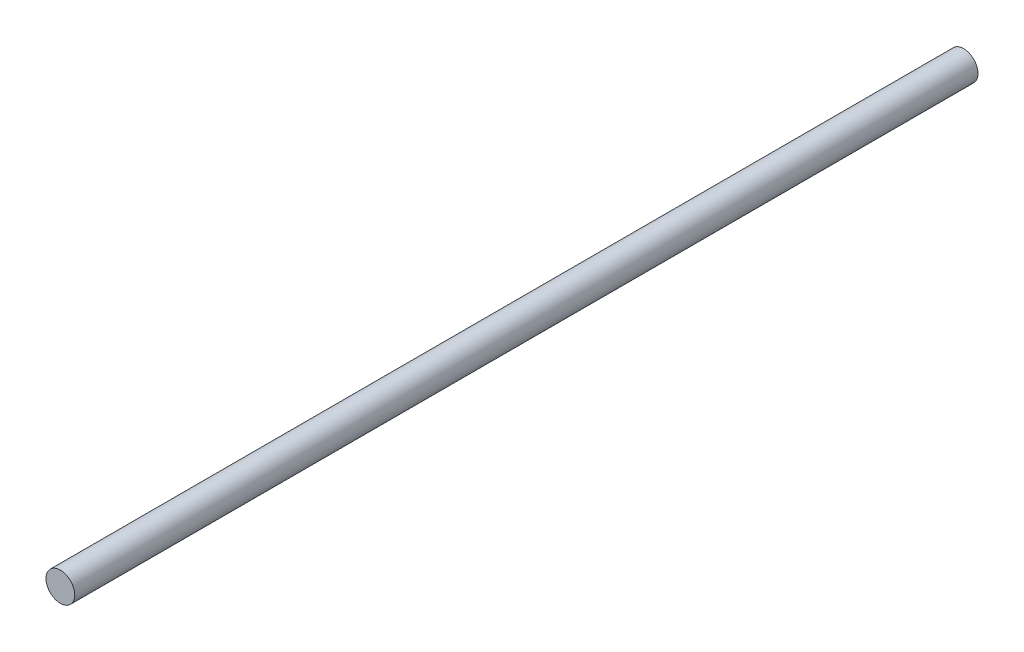
ISO-10303-21;
HEADER;
FILE_DESCRIPTION(('STEP AP214'),'2;1');
FILE_NAME('part.step','',(''),(''),'','','');
FILE_SCHEMA(('AUTOMOTIVE_DESIGN { 1 0 10303 214 1 1 1 1 }'));
ENDSEC;
DATA;
#1=APPLICATION_CONTEXT('core data for automotive mechanical design processes');
#2=APPLICATION_PROTOCOL_DEFINITION('international standard','automotive_design',2000,#1);
#3=PRODUCT_CONTEXT('',#1,'mechanical');
#4=PRODUCT('Part','Part','',(#3));
#5=PRODUCT_RELATED_PRODUCT_CATEGORY('part','',(#4));
#6=PRODUCT_DEFINITION_FORMATION('','',#4);
#7=PRODUCT_DEFINITION_CONTEXT('part definition',#1,'design');
#8=PRODUCT_DEFINITION('design','',#6,#7);
#9=PRODUCT_DEFINITION_SHAPE('','',#8);
#10=(LENGTH_UNIT() NAMED_UNIT(*) SI_UNIT(.MILLI.,.METRE.));
#11=(NAMED_UNIT(*) PLANE_ANGLE_UNIT() SI_UNIT($,.RADIAN.));
#12=(NAMED_UNIT(*) SI_UNIT($,.STERADIAN.) SOLID_ANGLE_UNIT());
#13=UNCERTAINTY_MEASURE_WITH_UNIT(LENGTH_MEASURE(1.E-05),#10,'distance_accuracy_value','');
#14=(GEOMETRIC_REPRESENTATION_CONTEXT(3) GLOBAL_UNCERTAINTY_ASSIGNED_CONTEXT((#13)) GLOBAL_UNIT_ASSIGNED_CONTEXT((#10,
#11,#12)) REPRESENTATION_CONTEXT('',''));
#15=CARTESIAN_POINT('',(0.,0.,0.));
#16=DIRECTION('',(0.,0.,1.));
#17=DIRECTION('',(1.,0.,0.));
#18=AXIS2_PLACEMENT_3D('',#15,#16,#17);
#19=CARTESIAN_POINT('',(0.,0.,320.));
#20=DIRECTION('',(0.,0.,-1.));
#21=DIRECTION('',(-1.,0.,0.));
#22=AXIS2_PLACEMENT_3D('',#19,#20,#21);
#23=CYLINDRICAL_SURFACE('',#22,5.1);
#24=CARTESIAN_POINT('',(0.,0.,320.));
#25=DIRECTION('',(0.,0.,1.));
#26=DIRECTION('',(1.,0.,0.));
#27=AXIS2_PLACEMENT_3D('',#24,#25,#26);
#28=CIRCLE('',#27,5.1);
#29=CARTESIAN_POINT('',(5.1,0.,320.));
#30=VERTEX_POINT('',#29);
#31=EDGE_CURVE('E10',#30,#30,#28,.T.);
#32=ORIENTED_EDGE('',*,*,#31,.F.);
#33=EDGE_LOOP('',(#32));
#34=FACE_BOUND('',#33,.T.);
#35=CARTESIAN_POINT('',(0.,0.,0.));
#36=DIRECTION('',(0.,0.,1.));
#37=DIRECTION('',(1.,0.,0.));
#38=AXIS2_PLACEMENT_3D('',#35,#36,#37);
#39=CIRCLE('',#38,5.1);
#40=CARTESIAN_POINT('',(5.1,0.,0.));
#41=VERTEX_POINT('',#40);
#42=EDGE_CURVE('E40',#41,#41,#39,.T.);
#43=ORIENTED_EDGE('',*,*,#42,.T.);
#44=EDGE_LOOP('',(#43));
#45=FACE_BOUND('',#44,.T.);
#46=ADVANCED_FACE('F37',(#34,#45),#23,.T.);
#47=CARTESIAN_POINT('',(0.,0.,320.));
#48=DIRECTION('',(0.,0.,1.));
#49=DIRECTION('',(1.,0.,0.));
#50=AXIS2_PLACEMENT_3D('',#47,#48,#49);
#51=PLANE('',#50);
#52=ORIENTED_EDGE('',*,*,#31,.T.);
#53=EDGE_LOOP('',(#52));
#54=FACE_BOUND('',#53,.T.);
#55=ADVANCED_FACE('F54',(#54),#51,.T.);
#56=CARTESIAN_POINT('',(0.,0.,0.));
#57=DIRECTION('',(0.,0.,1.));
#58=DIRECTION('',(1.,0.,0.));
#59=AXIS2_PLACEMENT_3D('',#56,#57,#58);
#60=PLANE('',#59);
#61=ORIENTED_EDGE('',*,*,#42,.F.);
#62=EDGE_LOOP('',(#61));
#63=FACE_BOUND('',#62,.T.);
#64=ADVANCED_FACE('F52',(#63),#60,.F.);
#65=CLOSED_SHELL('',(#46,#55,#64));
#66=MANIFOLD_SOLID_BREP('B2',#65);
#67=ADVANCED_BREP_SHAPE_REPRESENTATION('',(#18,#66),#14);
#68=SHAPE_DEFINITION_REPRESENTATION(#9,#67);
ENDSEC;
END-ISO-10303-21;
